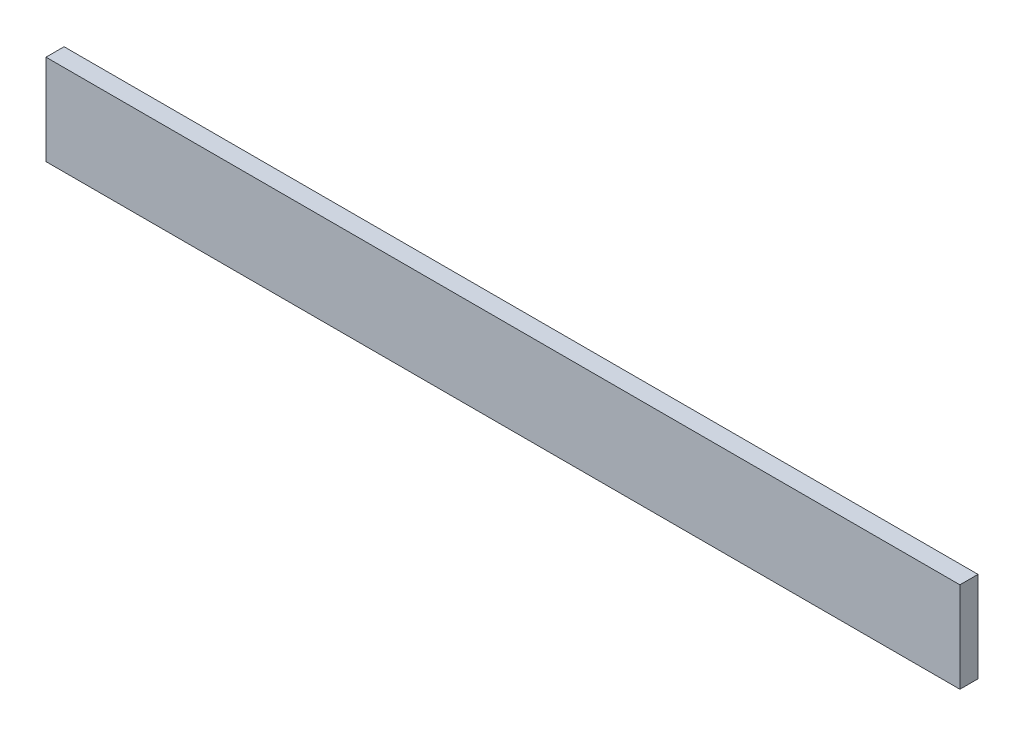
ISO-10303-21;
HEADER;
FILE_DESCRIPTION(('STEP AP214'),'2;1');
FILE_NAME('part.step','',(''),(''),'','','');
FILE_SCHEMA(('AUTOMOTIVE_DESIGN { 1 0 10303 214 1 1 1 1 }'));
ENDSEC;
DATA;
#1=APPLICATION_CONTEXT('core data for automotive mechanical design processes');
#2=APPLICATION_PROTOCOL_DEFINITION('international standard','automotive_design',2000,#1);
#3=PRODUCT_CONTEXT('',#1,'mechanical');
#4=PRODUCT('Part','Part','',(#3));
#5=PRODUCT_RELATED_PRODUCT_CATEGORY('part','',(#4));
#6=PRODUCT_DEFINITION_FORMATION('','',#4);
#7=PRODUCT_DEFINITION_CONTEXT('part definition',#1,'design');
#8=PRODUCT_DEFINITION('design','',#6,#7);
#9=PRODUCT_DEFINITION_SHAPE('','',#8);
#10=(LENGTH_UNIT() NAMED_UNIT(*) SI_UNIT(.MILLI.,.METRE.));
#11=(NAMED_UNIT(*) PLANE_ANGLE_UNIT() SI_UNIT($,.RADIAN.));
#12=(NAMED_UNIT(*) SI_UNIT($,.STERADIAN.) SOLID_ANGLE_UNIT());
#13=UNCERTAINTY_MEASURE_WITH_UNIT(LENGTH_MEASURE(1.E-05),#10,'distance_accuracy_value','');
#14=(GEOMETRIC_REPRESENTATION_CONTEXT(3) GLOBAL_UNCERTAINTY_ASSIGNED_CONTEXT((#13)) GLOBAL_UNIT_ASSIGNED_CONTEXT((#10,
#11,#12)) REPRESENTATION_CONTEXT('',''));
#15=CARTESIAN_POINT('',(0.,0.,0.));
#16=DIRECTION('',(0.,0.,1.));
#17=DIRECTION('',(1.,0.,0.));
#18=AXIS2_PLACEMENT_3D('',#15,#16,#17);
#19=CARTESIAN_POINT('',(0.,0.,10.));
#20=DIRECTION('',(1.,0.,0.));
#21=DIRECTION('',(0.,0.,-1.));
#22=AXIS2_PLACEMENT_3D('',#19,#20,#21);
#23=PLANE('',#22);
#24=DIRECTION('',(0.,-1.,0.));
#25=VECTOR('',#24,1.);
#26=CARTESIAN_POINT('',(0.,0.,0.));
#27=LINE('',#26,#25);
#28=CARTESIAN_POINT('',(0.,50.,0.));
#29=VERTEX_POINT('',#28);
#30=CARTESIAN_POINT('',(0.,0.,0.));
#31=VERTEX_POINT('',#30);
#32=EDGE_CURVE('E98',#29,#31,#27,.T.);
#33=ORIENTED_EDGE('',*,*,#32,.T.);
#34=DIRECTION('',(0.,0.,-1.));
#35=VECTOR('',#34,1.);
#36=CARTESIAN_POINT('',(0.,0.,10.));
#37=LINE('',#36,#35);
#38=CARTESIAN_POINT('',(0.,0.,10.));
#39=VERTEX_POINT('',#38);
#40=EDGE_CURVE('E11',#39,#31,#37,.T.);
#41=ORIENTED_EDGE('',*,*,#40,.F.);
#42=DIRECTION('',(0.,-1.,0.));
#43=VECTOR('',#42,1.);
#44=CARTESIAN_POINT('',(0.,0.,10.));
#45=LINE('',#44,#43);
#46=CARTESIAN_POINT('',(0.,50.,10.));
#47=VERTEX_POINT('',#46);
#48=EDGE_CURVE('E86',#47,#39,#45,.T.);
#49=ORIENTED_EDGE('',*,*,#48,.F.);
#50=DIRECTION('',(0.,0.,-1.));
#51=VECTOR('',#50,1.);
#52=CARTESIAN_POINT('',(0.,50.,10.));
#53=LINE('',#52,#51);
#54=EDGE_CURVE('E94',#47,#29,#53,.T.);
#55=ORIENTED_EDGE('',*,*,#54,.T.);
#56=EDGE_LOOP('',(#33,#41,#49,#55));
#57=FACE_BOUND('',#56,.T.);
#58=ADVANCED_FACE('F35',(#57),#23,.F.);
#59=CARTESIAN_POINT('',(0.,0.,10.));
#60=DIRECTION('',(0.,1.,0.));
#61=DIRECTION('',(0.,0.,1.));
#62=AXIS2_PLACEMENT_3D('',#59,#60,#61);
#63=PLANE('',#62);
#64=DIRECTION('',(1.,0.,0.));
#65=VECTOR('',#64,1.);
#66=CARTESIAN_POINT('',(0.,0.,0.));
#67=LINE('',#66,#65);
#68=CARTESIAN_POINT('',(505.,0.,0.));
#69=VERTEX_POINT('',#68);
#70=EDGE_CURVE('E90',#31,#69,#67,.T.);
#71=ORIENTED_EDGE('',*,*,#70,.T.);
#72=DIRECTION('',(0.,0.,-1.));
#73=VECTOR('',#72,1.);
#74=CARTESIAN_POINT('',(505.,0.,10.));
#75=LINE('',#74,#73);
#76=CARTESIAN_POINT('',(505.,0.,10.));
#77=VERTEX_POINT('',#76);
#78=EDGE_CURVE('E43',#77,#69,#75,.T.);
#79=ORIENTED_EDGE('',*,*,#78,.F.);
#80=DIRECTION('',(1.,0.,0.));
#81=VECTOR('',#80,1.);
#82=CARTESIAN_POINT('',(0.,0.,10.));
#83=LINE('',#82,#81);
#84=EDGE_CURVE('E81',#39,#77,#83,.T.);
#85=ORIENTED_EDGE('',*,*,#84,.F.);
#86=ORIENTED_EDGE('',*,*,#40,.T.);
#87=EDGE_LOOP('',(#71,#79,#85,#86));
#88=FACE_BOUND('',#87,.T.);
#89=ADVANCED_FACE('F89',(#88),#63,.F.);
#90=CARTESIAN_POINT('',(505.,0.,10.));
#91=DIRECTION('',(-1.,0.,0.));
#92=DIRECTION('',(0.,0.,1.));
#93=AXIS2_PLACEMENT_3D('',#90,#91,#92);
#94=PLANE('',#93);
#95=DIRECTION('',(0.,1.,0.));
#96=VECTOR('',#95,1.);
#97=CARTESIAN_POINT('',(505.,0.,0.));
#98=LINE('',#97,#96);
#99=CARTESIAN_POINT('',(505.,50.,0.));
#100=VERTEX_POINT('',#99);
#101=EDGE_CURVE('E68',#69,#100,#98,.T.);
#102=ORIENTED_EDGE('',*,*,#101,.T.);
#103=DIRECTION('',(0.,0.,-1.));
#104=VECTOR('',#103,1.);
#105=CARTESIAN_POINT('',(505.,50.,10.));
#106=LINE('',#105,#104);
#107=CARTESIAN_POINT('',(505.,50.,10.));
#108=VERTEX_POINT('',#107);
#109=EDGE_CURVE('E91',#108,#100,#106,.T.);
#110=ORIENTED_EDGE('',*,*,#109,.F.);
#111=DIRECTION('',(0.,1.,0.));
#112=VECTOR('',#111,1.);
#113=CARTESIAN_POINT('',(505.,0.,10.));
#114=LINE('',#113,#112);
#115=EDGE_CURVE('E84',#77,#108,#114,.T.);
#116=ORIENTED_EDGE('',*,*,#115,.F.);
#117=ORIENTED_EDGE('',*,*,#78,.T.);
#118=EDGE_LOOP('',(#102,#110,#116,#117));
#119=FACE_BOUND('',#118,.T.);
#120=ADVANCED_FACE('F92',(#119),#94,.F.);
#121=CARTESIAN_POINT('',(0.,50.,10.));
#122=DIRECTION('',(0.,-1.,0.));
#123=DIRECTION('',(0.,0.,-1.));
#124=AXIS2_PLACEMENT_3D('',#121,#122,#123);
#125=PLANE('',#124);
#126=DIRECTION('',(-1.,0.,0.));
#127=VECTOR('',#126,1.);
#128=CARTESIAN_POINT('',(0.,50.,0.));
#129=LINE('',#128,#127);
#130=EDGE_CURVE('E74',#100,#29,#129,.T.);
#131=ORIENTED_EDGE('',*,*,#130,.T.);
#132=ORIENTED_EDGE('',*,*,#54,.F.);
#133=DIRECTION('',(-1.,0.,0.));
#134=VECTOR('',#133,1.);
#135=CARTESIAN_POINT('',(0.,50.,10.));
#136=LINE('',#135,#134);
#137=EDGE_CURVE('E51',#108,#47,#136,.T.);
#138=ORIENTED_EDGE('',*,*,#137,.F.);
#139=ORIENTED_EDGE('',*,*,#109,.T.);
#140=EDGE_LOOP('',(#131,#132,#138,#139));
#141=FACE_BOUND('',#140,.T.);
#142=ADVANCED_FACE('F105',(#141),#125,.F.);
#143=CARTESIAN_POINT('',(0.,0.,10.));
#144=DIRECTION('',(0.,0.,-1.));
#145=DIRECTION('',(-1.,0.,0.));
#146=AXIS2_PLACEMENT_3D('',#143,#144,#145);
#147=PLANE('',#146);
#148=ORIENTED_EDGE('',*,*,#48,.T.);
#149=ORIENTED_EDGE('',*,*,#84,.T.);
#150=ORIENTED_EDGE('',*,*,#115,.T.);
#151=ORIENTED_EDGE('',*,*,#137,.T.);
#152=EDGE_LOOP('',(#148,#149,#150,#151));
#153=FACE_BOUND('',#152,.T.);
#154=ADVANCED_FACE('F82',(#153),#147,.F.);
#155=CARTESIAN_POINT('',(0.,0.,0.));
#156=DIRECTION('',(0.,0.,-1.));
#157=DIRECTION('',(-1.,0.,0.));
#158=AXIS2_PLACEMENT_3D('',#155,#156,#157);
#159=PLANE('',#158);
#160=ORIENTED_EDGE('',*,*,#32,.F.);
#161=ORIENTED_EDGE('',*,*,#130,.F.);
#162=ORIENTED_EDGE('',*,*,#101,.F.);
#163=ORIENTED_EDGE('',*,*,#70,.F.);
#164=EDGE_LOOP('',(#160,#161,#162,#163));
#165=FACE_BOUND('',#164,.T.);
#166=ADVANCED_FACE('F108',(#165),#159,.T.);
#167=CLOSED_SHELL('',(#58,#89,#120,#142,#154,#166));
#168=MANIFOLD_SOLID_BREP('B2',#167);
#169=ADVANCED_BREP_SHAPE_REPRESENTATION('',(#18,#168),#14);
#170=SHAPE_DEFINITION_REPRESENTATION(#9,#169);
ENDSEC;
END-ISO-10303-21;
